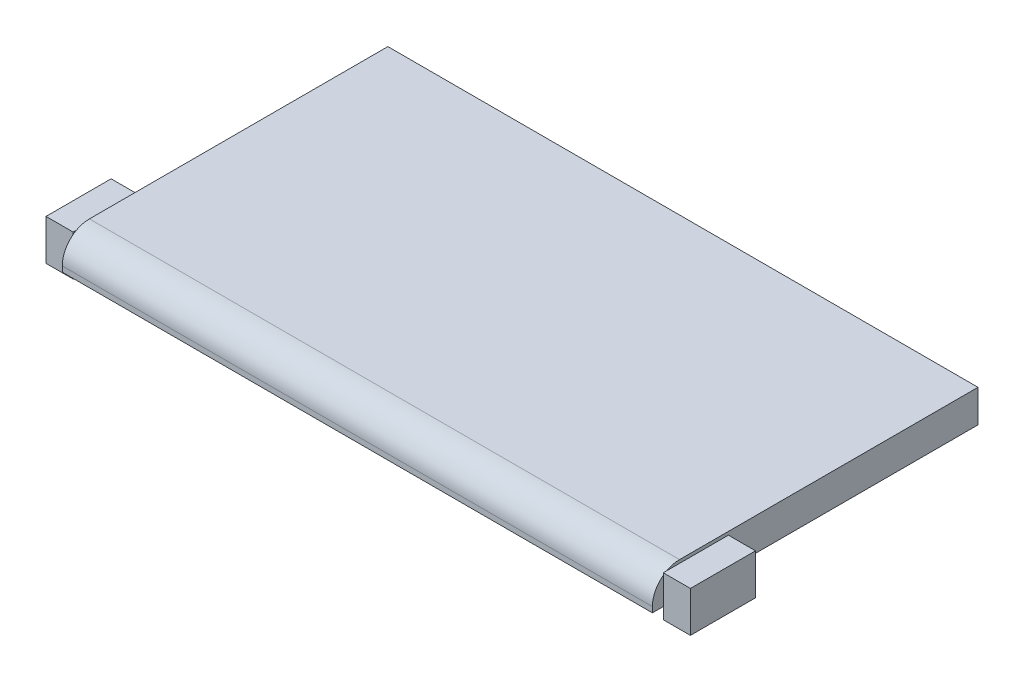
ISO-10303-21;
HEADER;
FILE_DESCRIPTION(('STEP AP214'),'2;1');
FILE_NAME('part.step','',(''),(''),'','','');
FILE_SCHEMA(('AUTOMOTIVE_DESIGN { 1 0 10303 214 1 1 1 1 }'));
ENDSEC;
DATA;
#1=APPLICATION_CONTEXT('core data for automotive mechanical design processes');
#2=APPLICATION_PROTOCOL_DEFINITION('international standard','automotive_design',2000,#1);
#3=PRODUCT_CONTEXT('',#1,'mechanical');
#4=PRODUCT('Part','Part','',(#3));
#5=PRODUCT_RELATED_PRODUCT_CATEGORY('part','',(#4));
#6=PRODUCT_DEFINITION_FORMATION('','',#4);
#7=PRODUCT_DEFINITION_CONTEXT('part definition',#1,'design');
#8=PRODUCT_DEFINITION('design','',#6,#7);
#9=PRODUCT_DEFINITION_SHAPE('','',#8);
#10=(LENGTH_UNIT() NAMED_UNIT(*) SI_UNIT(.MILLI.,.METRE.));
#11=(NAMED_UNIT(*) PLANE_ANGLE_UNIT() SI_UNIT($,.RADIAN.));
#12=(NAMED_UNIT(*) SI_UNIT($,.STERADIAN.) SOLID_ANGLE_UNIT());
#13=UNCERTAINTY_MEASURE_WITH_UNIT(LENGTH_MEASURE(1.E-05),#10,'distance_accuracy_value','');
#14=(GEOMETRIC_REPRESENTATION_CONTEXT(3) GLOBAL_UNCERTAINTY_ASSIGNED_CONTEXT((#13)) GLOBAL_UNIT_ASSIGNED_CONTEXT((#10,
#11,#12)) REPRESENTATION_CONTEXT('',''));
#15=CARTESIAN_POINT('',(0.,0.,0.));
#16=DIRECTION('',(0.,0.,1.));
#17=DIRECTION('',(1.,0.,0.));
#18=AXIS2_PLACEMENT_3D('',#15,#16,#17);
#19=CARTESIAN_POINT('',(287.401,13.716,-3.556));
#20=DIRECTION('',(0.,0.,-1.));
#21=DIRECTION('',(-1.,0.,0.));
#22=AXIS2_PLACEMENT_3D('',#19,#20,#21);
#23=PLANE('',#22);
#24=DIRECTION('',(0.,-1.,0.));
#25=VECTOR('',#24,1.);
#26=CARTESIAN_POINT('',(274.701,13.716,-3.556));
#27=LINE('',#26,#25);
#28=CARTESIAN_POINT('',(274.701,13.716,-3.556));
#29=VERTEX_POINT('',#28);
#30=CARTESIAN_POINT('',(274.701,-5.334,-3.556));
#31=VERTEX_POINT('',#30);
#32=EDGE_CURVE('E125',#29,#31,#27,.T.);
#33=ORIENTED_EDGE('',*,*,#32,.T.);
#34=DIRECTION('',(-1.,0.,0.));
#35=VECTOR('',#34,1.);
#36=CARTESIAN_POINT('',(287.401,-5.334,-3.55600000000001));
#37=LINE('',#36,#35);
#38=CARTESIAN_POINT('',(287.401,-5.334,-3.55600000000001));
#39=VERTEX_POINT('',#38);
#40=EDGE_CURVE('E12',#39,#31,#37,.T.);
#41=ORIENTED_EDGE('',*,*,#40,.F.);
#42=DIRECTION('',(0.,-1.,0.));
#43=VECTOR('',#42,1.);
#44=CARTESIAN_POINT('',(287.401,13.716,-3.556));
#45=LINE('',#44,#43);
#46=CARTESIAN_POINT('',(287.401,13.716,-3.556));
#47=VERTEX_POINT('',#46);
#48=EDGE_CURVE('E113',#47,#39,#45,.T.);
#49=ORIENTED_EDGE('',*,*,#48,.F.);
#50=DIRECTION('',(-1.,0.,0.));
#51=VECTOR('',#50,1.);
#52=CARTESIAN_POINT('',(287.401,13.716,-3.556));
#53=LINE('',#52,#51);
#54=EDGE_CURVE('E121',#47,#29,#53,.T.);
#55=ORIENTED_EDGE('',*,*,#54,.T.);
#56=EDGE_LOOP('',(#33,#41,#49,#55));
#57=FACE_BOUND('',#56,.T.);
#58=ADVANCED_FACE('F62',(#57),#23,.F.);
#59=CARTESIAN_POINT('',(287.401,-5.334,-3.55600000000001));
#60=DIRECTION('',(0.,1.,0.));
#61=DIRECTION('',(0.,0.,1.));
#62=AXIS2_PLACEMENT_3D('',#59,#60,#61);
#63=PLANE('',#62);
#64=DIRECTION('',(0.,0.,-1.));
#65=VECTOR('',#64,1.);
#66=CARTESIAN_POINT('',(274.701,-5.334,-3.556));
#67=LINE('',#66,#65);
#68=CARTESIAN_POINT('',(274.701,-5.334,-34.036));
#69=VERTEX_POINT('',#68);
#70=EDGE_CURVE('E117',#31,#69,#67,.T.);
#71=ORIENTED_EDGE('',*,*,#70,.T.);
#72=DIRECTION('',(-1.,0.,0.));
#73=VECTOR('',#72,1.);
#74=CARTESIAN_POINT('',(287.401,-5.334,-34.036));
#75=LINE('',#74,#73);
#76=CARTESIAN_POINT('',(287.401,-5.334,-34.036));
#77=VERTEX_POINT('',#76);
#78=EDGE_CURVE('E70',#77,#69,#75,.T.);
#79=ORIENTED_EDGE('',*,*,#78,.F.);
#80=DIRECTION('',(0.,0.,-1.));
#81=VECTOR('',#80,1.);
#82=CARTESIAN_POINT('',(287.401,-5.334,-3.55600000000001));
#83=LINE('',#82,#81);
#84=EDGE_CURVE('E108',#39,#77,#83,.T.);
#85=ORIENTED_EDGE('',*,*,#84,.F.);
#86=ORIENTED_EDGE('',*,*,#40,.T.);
#87=EDGE_LOOP('',(#71,#79,#85,#86));
#88=FACE_BOUND('',#87,.T.);
#89=ADVANCED_FACE('F116',(#88),#63,.F.);
#90=CARTESIAN_POINT('',(287.401,13.716,-34.036));
#91=DIRECTION('',(0.,0.,1.));
#92=DIRECTION('',(1.,0.,0.));
#93=AXIS2_PLACEMENT_3D('',#90,#91,#92);
#94=PLANE('',#93);
#95=DIRECTION('',(0.,1.,0.));
#96=VECTOR('',#95,1.);
#97=CARTESIAN_POINT('',(274.701,13.716,-34.036));
#98=LINE('',#97,#96);
#99=CARTESIAN_POINT('',(274.701,13.716,-34.036));
#100=VERTEX_POINT('',#99);
#101=EDGE_CURVE('E95',#69,#100,#98,.T.);
#102=ORIENTED_EDGE('',*,*,#101,.T.);
#103=DIRECTION('',(-1.,0.,0.));
#104=VECTOR('',#103,1.);
#105=CARTESIAN_POINT('',(287.401,13.716,-34.036));
#106=LINE('',#105,#104);
#107=CARTESIAN_POINT('',(287.401,13.716,-34.036));
#108=VERTEX_POINT('',#107);
#109=EDGE_CURVE('E118',#108,#100,#106,.T.);
#110=ORIENTED_EDGE('',*,*,#109,.F.);
#111=DIRECTION('',(0.,1.,0.));
#112=VECTOR('',#111,1.);
#113=CARTESIAN_POINT('',(287.401,13.716,-34.036));
#114=LINE('',#113,#112);
#115=EDGE_CURVE('E111',#77,#108,#114,.T.);
#116=ORIENTED_EDGE('',*,*,#115,.F.);
#117=ORIENTED_EDGE('',*,*,#78,.T.);
#118=EDGE_LOOP('',(#102,#110,#116,#117));
#119=FACE_BOUND('',#118,.T.);
#120=ADVANCED_FACE('F119',(#119),#94,.F.);
#121=CARTESIAN_POINT('',(287.401,13.716,-3.556));
#122=DIRECTION('',(0.,-1.,0.));
#123=DIRECTION('',(0.,0.,-1.));
#124=AXIS2_PLACEMENT_3D('',#121,#122,#123);
#125=PLANE('',#124);
#126=DIRECTION('',(0.,0.,1.));
#127=VECTOR('',#126,1.);
#128=CARTESIAN_POINT('',(274.701,13.716,-3.556));
#129=LINE('',#128,#127);
#130=EDGE_CURVE('E101',#100,#29,#129,.T.);
#131=ORIENTED_EDGE('',*,*,#130,.T.);
#132=ORIENTED_EDGE('',*,*,#54,.F.);
#133=DIRECTION('',(0.,0.,1.));
#134=VECTOR('',#133,1.);
#135=CARTESIAN_POINT('',(287.401,13.716,-3.556));
#136=LINE('',#135,#134);
#137=EDGE_CURVE('E78',#108,#47,#136,.T.);
#138=ORIENTED_EDGE('',*,*,#137,.F.);
#139=ORIENTED_EDGE('',*,*,#109,.T.);
#140=EDGE_LOOP('',(#131,#132,#138,#139));
#141=FACE_BOUND('',#140,.T.);
#142=ADVANCED_FACE('F132',(#141),#125,.F.);
#143=CARTESIAN_POINT('',(287.401,0.,0.));
#144=DIRECTION('',(1.,0.,0.));
#145=DIRECTION('',(0.,0.,-1.));
#146=AXIS2_PLACEMENT_3D('',#143,#144,#145);
#147=PLANE('',#146);
#148=ORIENTED_EDGE('',*,*,#48,.T.);
#149=ORIENTED_EDGE('',*,*,#84,.T.);
#150=ORIENTED_EDGE('',*,*,#115,.T.);
#151=ORIENTED_EDGE('',*,*,#137,.T.);
#152=EDGE_LOOP('',(#148,#149,#150,#151));
#153=FACE_BOUND('',#152,.T.);
#154=ADVANCED_FACE('F109',(#153),#147,.T.);
#155=CARTESIAN_POINT('',(274.701,0.,0.));
#156=DIRECTION('',(1.,0.,0.));
#157=DIRECTION('',(0.,0.,-1.));
#158=AXIS2_PLACEMENT_3D('',#155,#156,#157);
#159=PLANE('',#158);
#160=ORIENTED_EDGE('',*,*,#32,.F.);
#161=ORIENTED_EDGE('',*,*,#130,.F.);
#162=ORIENTED_EDGE('',*,*,#101,.F.);
#163=ORIENTED_EDGE('',*,*,#70,.F.);
#164=EDGE_LOOP('',(#160,#161,#162,#163));
#165=FACE_BOUND('',#164,.T.);
#166=ADVANCED_FACE('F135',(#165),#159,.F.);
#167=CLOSED_SHELL('',(#58,#89,#120,#142,#154,#166));
#168=MANIFOLD_SOLID_BREP('B2',#167);
#169=CARTESIAN_POINT('',(-1.524,15.24,0.));
#170=DIRECTION('',(-1.,0.,0.));
#171=DIRECTION('',(0.,0.,1.));
#172=AXIS2_PLACEMENT_3D('',#169,#170,#171);
#173=PLANE('',#172);
#174=CARTESIAN_POINT('',(-1.524,2.54,-11.176));
#175=DIRECTION('',(-1.,0.,0.));
#176=DIRECTION('',(0.,0.,1.));
#177=AXIS2_PLACEMENT_3D('',#174,#175,#176);
#178=CIRCLE('',#177,12.7);
#179=CARTESIAN_POINT('',(-1.524,2.54,1.524));
#180=VERTEX_POINT('',#179);
#181=CARTESIAN_POINT('',(-1.52400000000003,12.7,-3.55599999999995));
#182=VERTEX_POINT('',#181);
#183=EDGE_CURVE('E213',#180,#182,#178,.T.);
#184=ORIENTED_EDGE('',*,*,#183,.T.);
#185=DIRECTION('',(0.,-1.,0.));
#186=VECTOR('',#185,1.);
#187=CARTESIAN_POINT('',(-1.52400000000003,13.716,-3.55599999999995));
#188=LINE('',#187,#186);
#189=CARTESIAN_POINT('',(-1.52400000000003,0.,-3.55599999999995));
#190=VERTEX_POINT('',#189);
#191=EDGE_CURVE('E60',#182,#190,#188,.T.);
#192=ORIENTED_EDGE('',*,*,#191,.T.);
#193=DIRECTION('',(0.,0.,-1.));
#194=VECTOR('',#193,1.);
#195=CARTESIAN_POINT('',(-1.524,0.,0.));
#196=LINE('',#195,#194);
#197=CARTESIAN_POINT('',(-1.524,0.,1.524));
#198=VERTEX_POINT('',#197);
#199=EDGE_CURVE('E498',#198,#190,#196,.T.);
#200=ORIENTED_EDGE('',*,*,#199,.F.);
#201=DIRECTION('',(0.,-1.,0.));
#202=VECTOR('',#201,1.);
#203=CARTESIAN_POINT('',(-1.524,15.24,1.524));
#204=LINE('',#203,#202);
#205=EDGE_CURVE('E505',#180,#198,#204,.T.);
#206=ORIENTED_EDGE('',*,*,#205,.F.);
#207=EDGE_LOOP('',(#184,#192,#200,#206));
#208=FACE_BOUND('',#207,.T.);
#209=ADVANCED_FACE('F209',(#208),#173,.T.);
#210=CARTESIAN_POINT('',(-1.52400000000003,0.,-34.0359999999999));
#211=VERTEX_POINT('',#210);
#212=CARTESIAN_POINT('',(-1.524,0.,-150.876));
#213=VERTEX_POINT('',#212);
#214=EDGE_CURVE('E518',#211,#213,#196,.T.);
#215=ORIENTED_EDGE('',*,*,#214,.F.);
#216=DIRECTION('',(0.,1.,0.));
#217=VECTOR('',#216,1.);
#218=CARTESIAN_POINT('',(-1.52400000000003,13.716,-34.0359999999999));
#219=LINE('',#218,#217);
#220=CARTESIAN_POINT('',(-1.52400000000003,13.716,-34.0359999999999));
#221=VERTEX_POINT('',#220);
#222=EDGE_CURVE('E219',#211,#221,#219,.T.);
#223=ORIENTED_EDGE('',*,*,#222,.T.);
#224=DIRECTION('',(0.,0.,1.));
#225=VECTOR('',#224,1.);
#226=CARTESIAN_POINT('',(-1.52400000000003,13.716,-3.55599999999995));
#227=LINE('',#226,#225);
#228=CARTESIAN_POINT('',(-1.524,13.716,-5.14383421978473));
#229=VERTEX_POINT('',#228);
#230=EDGE_CURVE('E397',#221,#229,#227,.T.);
#231=ORIENTED_EDGE('',*,*,#230,.T.);
#232=CARTESIAN_POINT('',(-1.524,15.24,-11.176));
#233=VERTEX_POINT('',#232);
#234=EDGE_CURVE('E543',#229,#233,#178,.T.);
#235=ORIENTED_EDGE('',*,*,#234,.T.);
#236=DIRECTION('',(0.,0.,-1.));
#237=VECTOR('',#236,1.);
#238=CARTESIAN_POINT('',(-1.524,15.24,0.));
#239=LINE('',#238,#237);
#240=CARTESIAN_POINT('',(-1.524,15.24,-150.876));
#241=VERTEX_POINT('',#240);
#242=EDGE_CURVE('E502',#233,#241,#239,.T.);
#243=ORIENTED_EDGE('',*,*,#242,.T.);
#244=DIRECTION('',(0.,-1.,0.));
#245=VECTOR('',#244,1.);
#246=CARTESIAN_POINT('',(-1.524,15.24,-150.876));
#247=LINE('',#246,#245);
#248=EDGE_CURVE('E524',#241,#213,#247,.T.);
#249=ORIENTED_EDGE('',*,*,#248,.T.);
#250=EDGE_LOOP('',(#215,#223,#231,#235,#243,#249));
#251=FACE_BOUND('',#250,.T.);
#252=ADVANCED_FACE('F561',(#251),#173,.T.);
#253=CARTESIAN_POINT('',(0.,15.24,1.524));
#254=DIRECTION('',(0.,0.,-1.));
#255=DIRECTION('',(-1.,0.,0.));
#256=AXIS2_PLACEMENT_3D('',#253,#254,#255);
#257=PLANE('',#256);
#258=DIRECTION('',(0.,-1.,0.));
#259=VECTOR('',#258,1.);
#260=CARTESIAN_POINT('',(274.701,15.24,1.524));
#261=LINE('',#260,#259);
#262=CARTESIAN_POINT('',(274.701,2.54,1.524));
#263=VERTEX_POINT('',#262);
#264=CARTESIAN_POINT('',(274.701,0.,1.524));
#265=VERTEX_POINT('',#264);
#266=EDGE_CURVE('E532',#263,#265,#261,.T.);
#267=ORIENTED_EDGE('',*,*,#266,.F.);
#268=DIRECTION('',(1.,0.,0.));
#269=VECTOR('',#268,1.);
#270=CARTESIAN_POINT('',(-1.524,2.54,1.524));
#271=LINE('',#270,#269);
#272=EDGE_CURVE('E541',#263,#180,#271,.F.);
#273=ORIENTED_EDGE('',*,*,#272,.T.);
#274=ORIENTED_EDGE('',*,*,#205,.T.);
#275=DIRECTION('',(1.,0.,0.));
#276=VECTOR('',#275,1.);
#277=CARTESIAN_POINT('',(0.,0.,1.524));
#278=LINE('',#277,#276);
#279=EDGE_CURVE('E475',#198,#265,#278,.T.);
#280=ORIENTED_EDGE('',*,*,#279,.T.);
#281=EDGE_LOOP('',(#267,#273,#274,#280));
#282=FACE_BOUND('',#281,.T.);
#283=ADVANCED_FACE('F625',(#282),#257,.F.);
#284=CARTESIAN_POINT('',(274.701,15.24,-1.00058850094342E-13));
#285=DIRECTION('',(-1.,0.,0.));
#286=DIRECTION('',(0.,0.,1.));
#287=AXIS2_PLACEMENT_3D('',#284,#285,#286);
#288=PLANE('',#287);
#289=DIRECTION('',(0.,0.,-1.));
#290=VECTOR('',#289,1.);
#291=CARTESIAN_POINT('',(274.701,15.24,-1.00058850094342E-13));
#292=LINE('',#291,#290);
#293=CARTESIAN_POINT('',(274.701,15.24,-11.176));
#294=VERTEX_POINT('',#293);
#295=CARTESIAN_POINT('',(274.701,15.24,-150.876));
#296=VERTEX_POINT('',#295);
#297=EDGE_CURVE('E494',#294,#296,#292,.T.);
#298=ORIENTED_EDGE('',*,*,#297,.F.);
#299=CARTESIAN_POINT('',(274.701,2.54,-11.176));
#300=DIRECTION('',(-1.,0.,0.));
#301=DIRECTION('',(0.,0.,1.));
#302=AXIS2_PLACEMENT_3D('',#299,#300,#301);
#303=CIRCLE('',#302,12.7);
#304=EDGE_CURVE('E539',#294,#263,#303,.F.);
#305=ORIENTED_EDGE('',*,*,#304,.T.);
#306=ORIENTED_EDGE('',*,*,#266,.T.);
#307=DIRECTION('',(0.,0.,-1.));
#308=VECTOR('',#307,1.);
#309=CARTESIAN_POINT('',(274.701,0.,-1.00058850094342E-13));
#310=LINE('',#309,#308);
#311=CARTESIAN_POINT('',(274.701,0.,-150.876));
#312=VERTEX_POINT('',#311);
#313=EDGE_CURVE('E509',#265,#312,#310,.T.);
#314=ORIENTED_EDGE('',*,*,#313,.T.);
#315=DIRECTION('',(0.,-1.,0.));
#316=VECTOR('',#315,1.);
#317=CARTESIAN_POINT('',(274.701,15.24,-150.876));
#318=LINE('',#317,#316);
#319=EDGE_CURVE('E528',#296,#312,#318,.T.);
#320=ORIENTED_EDGE('',*,*,#319,.F.);
#321=EDGE_LOOP('',(#298,#305,#306,#314,#320));
#322=FACE_BOUND('',#321,.T.);
#323=ADVANCED_FACE('F579',(#322),#288,.F.);
#324=CARTESIAN_POINT('',(0.,15.24,-150.876));
#325=DIRECTION('',(0.,0.,-1.));
#326=DIRECTION('',(-1.,0.,0.));
#327=AXIS2_PLACEMENT_3D('',#324,#325,#326);
#328=PLANE('',#327);
#329=DIRECTION('',(0.,-1.,0.));
#330=VECTOR('',#329,1.);
#331=CARTESIAN_POINT('',(187.3885,0.,-150.876));
#332=LINE('',#331,#330);
#333=CARTESIAN_POINT('',(187.3885,3.175,-150.876));
#334=VERTEX_POINT('',#333);
#335=CARTESIAN_POINT('',(187.3885,0.,-150.876));
#336=VERTEX_POINT('',#335);
#337=EDGE_CURVE('E415',#334,#336,#332,.T.);
#338=ORIENTED_EDGE('',*,*,#337,.F.);
#339=DIRECTION('',(-1.,0.,0.));
#340=VECTOR('',#339,1.);
#341=CARTESIAN_POINT('',(187.3885,3.175,-150.876));
#342=LINE('',#341,#340);
#343=CARTESIAN_POINT('',(85.7885,3.175,-150.876));
#344=VERTEX_POINT('',#343);
#345=EDGE_CURVE('E434',#334,#344,#342,.T.);
#346=ORIENTED_EDGE('',*,*,#345,.T.);
#347=DIRECTION('',(0.,-1.,0.));
#348=VECTOR('',#347,1.);
#349=CARTESIAN_POINT('',(85.7885,0.,-150.876));
#350=LINE('',#349,#348);
#351=CARTESIAN_POINT('',(85.7885,0.,-150.876));
#352=VERTEX_POINT('',#351);
#353=EDGE_CURVE('E409',#344,#352,#350,.T.);
#354=ORIENTED_EDGE('',*,*,#353,.T.);
#355=DIRECTION('',(1.,0.,0.));
#356=VECTOR('',#355,1.);
#357=CARTESIAN_POINT('',(0.,0.,-150.876));
#358=LINE('',#357,#356);
#359=EDGE_CURVE('E514',#213,#352,#358,.T.);
#360=ORIENTED_EDGE('',*,*,#359,.F.);
#361=ORIENTED_EDGE('',*,*,#248,.F.);
#362=DIRECTION('',(1.,0.,0.));
#363=VECTOR('',#362,1.);
#364=CARTESIAN_POINT('',(0.,15.24,-150.876));
#365=LINE('',#364,#363);
#366=EDGE_CURVE('E497',#241,#296,#365,.T.);
#367=ORIENTED_EDGE('',*,*,#366,.T.);
#368=ORIENTED_EDGE('',*,*,#319,.T.);
#369=EDGE_CURVE('E513',#336,#312,#358,.T.);
#370=ORIENTED_EDGE('',*,*,#369,.F.);
#371=EDGE_LOOP('',(#338,#346,#354,#360,#361,#367,#368,#370));
#372=FACE_BOUND('',#371,.T.);
#373=ADVANCED_FACE('F585',(#372),#328,.T.);
#374=CARTESIAN_POINT('',(0.,15.24,0.));
#375=DIRECTION('',(0.,1.,0.));
#376=DIRECTION('',(0.,0.,1.));
#377=AXIS2_PLACEMENT_3D('',#374,#375,#376);
#378=PLANE('',#377);
#379=ORIENTED_EDGE('',*,*,#242,.F.);
#380=DIRECTION('',(1.,0.,0.));
#381=VECTOR('',#380,1.);
#382=CARTESIAN_POINT('',(274.701,15.24,-11.176));
#383=LINE('',#382,#381);
#384=EDGE_CURVE('E535',#233,#294,#383,.T.);
#385=ORIENTED_EDGE('',*,*,#384,.T.);
#386=ORIENTED_EDGE('',*,*,#297,.T.);
#387=ORIENTED_EDGE('',*,*,#366,.F.);
#388=EDGE_LOOP('',(#379,#385,#386,#387));
#389=FACE_BOUND('',#388,.T.);
#390=ADVANCED_FACE('F575',(#389),#378,.T.);
#391=CARTESIAN_POINT('',(0.,0.,0.));
#392=DIRECTION('',(0.,1.,0.));
#393=DIRECTION('',(0.,0.,1.));
#394=AXIS2_PLACEMENT_3D('',#391,#392,#393);
#395=PLANE('',#394);
#396=DIRECTION('',(0.,0.,-1.));
#397=VECTOR('',#396,1.);
#398=CARTESIAN_POINT('',(0.,0.,0.));
#399=LINE('',#398,#397);
#400=CARTESIAN_POINT('',(0.,0.,0.));
#401=VERTEX_POINT('',#400);
#402=CARTESIAN_POINT('',(0.,0.,-149.352));
#403=VERTEX_POINT('',#402);
#404=EDGE_CURVE('E462',#401,#403,#399,.T.);
#405=ORIENTED_EDGE('',*,*,#404,.F.);
#406=DIRECTION('',(1.,0.,0.));
#407=VECTOR('',#406,1.);
#408=CARTESIAN_POINT('',(0.,0.,0.));
#409=LINE('',#408,#407);
#410=CARTESIAN_POINT('',(273.177,0.,0.));
#411=VERTEX_POINT('',#410);
#412=EDGE_CURVE('E442',#401,#411,#409,.T.);
#413=ORIENTED_EDGE('',*,*,#412,.T.);
#414=DIRECTION('',(0.,0.,-1.));
#415=VECTOR('',#414,1.);
#416=CARTESIAN_POINT('',(273.177,0.,0.));
#417=LINE('',#416,#415);
#418=CARTESIAN_POINT('',(273.177,0.,-149.352));
#419=VERTEX_POINT('',#418);
#420=EDGE_CURVE('E484',#411,#419,#417,.T.);
#421=ORIENTED_EDGE('',*,*,#420,.T.);
#422=DIRECTION('',(1.,0.,0.));
#423=VECTOR('',#422,1.);
#424=CARTESIAN_POINT('',(0.,0.,-149.352));
#425=LINE('',#424,#423);
#426=EDGE_CURVE('E488',#403,#419,#425,.T.);
#427=ORIENTED_EDGE('',*,*,#426,.F.);
#428=EDGE_LOOP('',(#405,#413,#421,#427));
#429=FACE_BOUND('',#428,.T.);
#430=ORIENTED_EDGE('',*,*,#279,.F.);
#431=ORIENTED_EDGE('',*,*,#199,.T.);
#432=EDGE_CURVE('E351',#190,#211,#196,.T.);
#433=ORIENTED_EDGE('',*,*,#432,.T.);
#434=ORIENTED_EDGE('',*,*,#214,.T.);
#435=ORIENTED_EDGE('',*,*,#359,.T.);
#436=DIRECTION('',(-1.,0.,0.));
#437=VECTOR('',#436,1.);
#438=CARTESIAN_POINT('',(187.3885,0.,-150.876));
#439=LINE('',#438,#437);
#440=EDGE_CURVE('E418',#336,#352,#439,.T.);
#441=ORIENTED_EDGE('',*,*,#440,.F.);
#442=ORIENTED_EDGE('',*,*,#369,.T.);
#443=ORIENTED_EDGE('',*,*,#313,.F.);
#444=EDGE_LOOP('',(#430,#431,#433,#434,#435,#441,#442,#443));
#445=FACE_BOUND('',#444,.T.);
#446=ADVANCED_FACE('F591',(#429,#445),#395,.F.);
#447=CARTESIAN_POINT('',(0.,2.54,-11.176));
#448=DIRECTION('',(-1.,0.,0.));
#449=DIRECTION('',(0.,0.,1.));
#450=AXIS2_PLACEMENT_3D('',#447,#448,#449);
#451=CYLINDRICAL_SURFACE('',#450,12.7);
#452=ORIENTED_EDGE('',*,*,#183,.F.);
#453=ORIENTED_EDGE('',*,*,#272,.F.);
#454=ORIENTED_EDGE('',*,*,#304,.F.);
#455=ORIENTED_EDGE('',*,*,#384,.F.);
#456=ORIENTED_EDGE('',*,*,#234,.F.);
#457=EDGE_CURVE('E549',#182,#229,#178,.T.);
#458=ORIENTED_EDGE('',*,*,#457,.F.);
#459=EDGE_LOOP('',(#452,#453,#454,#455,#456,#458));
#460=FACE_BOUND('',#459,.T.);
#461=ADVANCED_FACE('F211',(#460),#451,.T.);
#462=CARTESIAN_POINT('',(0.,15.24,0.));
#463=DIRECTION('',(0.,0.,-1.));
#464=DIRECTION('',(-1.,0.,0.));
#465=AXIS2_PLACEMENT_3D('',#462,#463,#464);
#466=PLANE('',#465);
#467=DIRECTION('',(0.,-1.,0.));
#468=VECTOR('',#467,1.);
#469=CARTESIAN_POINT('',(273.177,15.24,0.));
#470=LINE('',#469,#468);
#471=CARTESIAN_POINT('',(273.177,2.54000000000001,0.));
#472=VERTEX_POINT('',#471);
#473=EDGE_CURVE('E443',#472,#411,#470,.T.);
#474=ORIENTED_EDGE('',*,*,#473,.T.);
#475=ORIENTED_EDGE('',*,*,#412,.F.);
#476=DIRECTION('',(0.,-1.,0.));
#477=VECTOR('',#476,1.);
#478=CARTESIAN_POINT('',(0.,15.24,0.));
#479=LINE('',#478,#477);
#480=CARTESIAN_POINT('',(0.,2.54000000000001,0.));
#481=VERTEX_POINT('',#480);
#482=EDGE_CURVE('E453',#481,#401,#479,.T.);
#483=ORIENTED_EDGE('',*,*,#482,.F.);
#484=DIRECTION('',(-1.,0.,0.));
#485=VECTOR('',#484,1.);
#486=CARTESIAN_POINT('',(0.,2.54000000000001,0.));
#487=LINE('',#486,#485);
#488=EDGE_CURVE('E448',#472,#481,#487,.T.);
#489=ORIENTED_EDGE('',*,*,#488,.F.);
#490=EDGE_LOOP('',(#474,#475,#483,#489));
#491=FACE_BOUND('',#490,.T.);
#492=ADVANCED_FACE('F652',(#491),#466,.T.);
#493=CARTESIAN_POINT('',(273.177,15.24,0.));
#494=DIRECTION('',(-1.,0.,0.));
#495=DIRECTION('',(0.,0.,1.));
#496=AXIS2_PLACEMENT_3D('',#493,#494,#495);
#497=PLANE('',#496);
#498=DIRECTION('',(0.,0.,-1.));
#499=VECTOR('',#498,1.);
#500=CARTESIAN_POINT('',(273.177,13.716,0.));
#501=LINE('',#500,#499);
#502=CARTESIAN_POINT('',(273.177,13.716,-11.176));
#503=VERTEX_POINT('',#502);
#504=CARTESIAN_POINT('',(273.177,13.716,-149.352));
#505=VERTEX_POINT('',#504);
#506=EDGE_CURVE('E458',#503,#505,#501,.T.);
#507=ORIENTED_EDGE('',*,*,#506,.T.);
#508=DIRECTION('',(0.,-1.,0.));
#509=VECTOR('',#508,1.);
#510=CARTESIAN_POINT('',(273.177,15.24,-149.352));
#511=LINE('',#510,#509);
#512=EDGE_CURVE('E447',#505,#419,#511,.T.);
#513=ORIENTED_EDGE('',*,*,#512,.T.);
#514=ORIENTED_EDGE('',*,*,#420,.F.);
#515=ORIENTED_EDGE('',*,*,#473,.F.);
#516=CARTESIAN_POINT('',(273.177,2.54,-11.176));
#517=DIRECTION('',(-1.,0.,0.));
#518=DIRECTION('',(0.,0.,1.));
#519=AXIS2_PLACEMENT_3D('',#516,#517,#518);
#520=CIRCLE('',#519,11.176);
#521=EDGE_CURVE('E452',#503,#472,#520,.F.);
#522=ORIENTED_EDGE('',*,*,#521,.F.);
#523=EDGE_LOOP('',(#507,#513,#514,#515,#522));
#524=FACE_BOUND('',#523,.T.);
#525=ADVANCED_FACE('F656',(#524),#497,.T.);
#526=CARTESIAN_POINT('',(0.,15.24,-149.352));
#527=DIRECTION('',(0.,0.,-1.));
#528=DIRECTION('',(-1.,0.,0.));
#529=AXIS2_PLACEMENT_3D('',#526,#527,#528);
#530=PLANE('',#529);
#531=ORIENTED_EDGE('',*,*,#426,.T.);
#532=ORIENTED_EDGE('',*,*,#512,.F.);
#533=DIRECTION('',(1.,0.,0.));
#534=VECTOR('',#533,1.);
#535=CARTESIAN_POINT('',(0.,13.716,-149.352));
#536=LINE('',#535,#534);
#537=CARTESIAN_POINT('',(0.,13.716,-149.352));
#538=VERTEX_POINT('',#537);
#539=EDGE_CURVE('E461',#538,#505,#536,.T.);
#540=ORIENTED_EDGE('',*,*,#539,.F.);
#541=DIRECTION('',(0.,-1.,0.));
#542=VECTOR('',#541,1.);
#543=CARTESIAN_POINT('',(0.,15.24,-149.352));
#544=LINE('',#543,#542);
#545=EDGE_CURVE('E456',#538,#403,#544,.T.);
#546=ORIENTED_EDGE('',*,*,#545,.T.);
#547=EDGE_LOOP('',(#531,#532,#540,#546));
#548=FACE_BOUND('',#547,.T.);
#549=ADVANCED_FACE('F666',(#548),#530,.F.);
#550=CARTESIAN_POINT('',(0.,15.24,0.));
#551=DIRECTION('',(-1.,0.,0.));
#552=DIRECTION('',(0.,0.,1.));
#553=AXIS2_PLACEMENT_3D('',#550,#551,#552);
#554=PLANE('',#553);
#555=ORIENTED_EDGE('',*,*,#482,.T.);
#556=ORIENTED_EDGE('',*,*,#404,.T.);
#557=ORIENTED_EDGE('',*,*,#545,.F.);
#558=DIRECTION('',(0.,0.,-1.));
#559=VECTOR('',#558,1.);
#560=CARTESIAN_POINT('',(0.,13.716,0.));
#561=LINE('',#560,#559);
#562=CARTESIAN_POINT('',(0.,13.716,-11.176));
#563=VERTEX_POINT('',#562);
#564=EDGE_CURVE('E457',#563,#538,#561,.T.);
#565=ORIENTED_EDGE('',*,*,#564,.F.);
#566=CARTESIAN_POINT('',(0.,2.54,-11.176));
#567=DIRECTION('',(-1.,0.,0.));
#568=DIRECTION('',(0.,0.,1.));
#569=AXIS2_PLACEMENT_3D('',#566,#567,#568);
#570=CIRCLE('',#569,11.176);
#571=EDGE_CURVE('E451',#481,#563,#570,.T.);
#572=ORIENTED_EDGE('',*,*,#571,.F.);
#573=EDGE_LOOP('',(#555,#556,#557,#565,#572));
#574=FACE_BOUND('',#573,.T.);
#575=ADVANCED_FACE('F675',(#574),#554,.F.);
#576=CARTESIAN_POINT('',(0.,13.716,0.));
#577=DIRECTION('',(0.,1.,0.));
#578=DIRECTION('',(0.,0.,1.));
#579=AXIS2_PLACEMENT_3D('',#576,#577,#578);
#580=PLANE('',#579);
#581=ORIENTED_EDGE('',*,*,#564,.T.);
#582=ORIENTED_EDGE('',*,*,#539,.T.);
#583=ORIENTED_EDGE('',*,*,#506,.F.);
#584=DIRECTION('',(1.,0.,0.));
#585=VECTOR('',#584,1.);
#586=CARTESIAN_POINT('',(0.,13.716,-11.176));
#587=LINE('',#586,#585);
#588=EDGE_CURVE('E446',#563,#503,#587,.T.);
#589=ORIENTED_EDGE('',*,*,#588,.F.);
#590=EDGE_LOOP('',(#581,#582,#583,#589));
#591=FACE_BOUND('',#590,.T.);
#592=ADVANCED_FACE('F615',(#591),#580,.F.);
#593=CARTESIAN_POINT('',(0.,2.54,-11.176));
#594=DIRECTION('',(-1.,0.,0.));
#595=DIRECTION('',(0.,0.,1.));
#596=AXIS2_PLACEMENT_3D('',#593,#594,#595);
#597=CYLINDRICAL_SURFACE('',#596,11.176);
#598=ORIENTED_EDGE('',*,*,#571,.T.);
#599=ORIENTED_EDGE('',*,*,#588,.T.);
#600=ORIENTED_EDGE('',*,*,#521,.T.);
#601=ORIENTED_EDGE('',*,*,#488,.T.);
#602=EDGE_LOOP('',(#598,#599,#600,#601));
#603=FACE_BOUND('',#602,.T.);
#604=ADVANCED_FACE('F606',(#603),#597,.F.);
#605=CARTESIAN_POINT('',(187.3885,0.,-154.051));
#606=DIRECTION('',(-1.,0.,0.));
#607=DIRECTION('',(0.,0.,1.));
#608=AXIS2_PLACEMENT_3D('',#605,#606,#607);
#609=CYLINDRICAL_SURFACE('',#608,3.175);
#610=CARTESIAN_POINT('',(85.7885,0.,-154.051));
#611=DIRECTION('',(1.,0.,0.));
#612=DIRECTION('',(0.,0.,-1.));
#613=AXIS2_PLACEMENT_3D('',#610,#611,#612);
#614=CIRCLE('',#613,3.175);
#615=CARTESIAN_POINT('',(85.7885,3.175,-154.051));
#616=VERTEX_POINT('',#615);
#617=EDGE_CURVE('E422',#352,#616,#614,.T.);
#618=ORIENTED_EDGE('',*,*,#617,.T.);
#619=DIRECTION('',(-1.,0.,0.));
#620=VECTOR('',#619,1.);
#621=CARTESIAN_POINT('',(187.3885,3.175,-154.051));
#622=LINE('',#621,#620);
#623=CARTESIAN_POINT('',(187.3885,3.175,-154.051));
#624=VERTEX_POINT('',#623);
#625=EDGE_CURVE('E438',#624,#616,#622,.T.);
#626=ORIENTED_EDGE('',*,*,#625,.F.);
#627=CARTESIAN_POINT('',(187.3885,0.,-154.051));
#628=DIRECTION('',(1.,0.,0.));
#629=DIRECTION('',(0.,0.,-1.));
#630=AXIS2_PLACEMENT_3D('',#627,#628,#629);
#631=CIRCLE('',#630,3.175);
#632=EDGE_CURVE('E237',#336,#624,#631,.T.);
#633=ORIENTED_EDGE('',*,*,#632,.F.);
#634=ORIENTED_EDGE('',*,*,#440,.T.);
#635=EDGE_LOOP('',(#618,#626,#633,#634));
#636=FACE_BOUND('',#635,.T.);
#637=ADVANCED_FACE('F604',(#636),#609,.T.);
#638=CARTESIAN_POINT('',(187.3885,3.17500000000008,0.));
#639=DIRECTION('',(0.,-1.,0.));
#640=DIRECTION('',(0.,0.,-1.));
#641=AXIS2_PLACEMENT_3D('',#638,#639,#640);
#642=PLANE('',#641);
#643=DIRECTION('',(0.,0.,1.));
#644=VECTOR('',#643,1.);
#645=CARTESIAN_POINT('',(85.7885,3.17500000000008,0.));
#646=LINE('',#645,#644);
#647=EDGE_CURVE('E426',#616,#344,#646,.T.);
#648=ORIENTED_EDGE('',*,*,#647,.T.);
#649=ORIENTED_EDGE('',*,*,#345,.F.);
#650=DIRECTION('',(0.,0.,1.));
#651=VECTOR('',#650,1.);
#652=CARTESIAN_POINT('',(187.3885,3.17500000000008,0.));
#653=LINE('',#652,#651);
#654=EDGE_CURVE('E412',#624,#334,#653,.T.);
#655=ORIENTED_EDGE('',*,*,#654,.F.);
#656=ORIENTED_EDGE('',*,*,#625,.T.);
#657=EDGE_LOOP('',(#648,#649,#655,#656));
#658=FACE_BOUND('',#657,.T.);
#659=ADVANCED_FACE('F600',(#658),#642,.F.);
#660=CARTESIAN_POINT('',(187.3885,0.,-154.051));
#661=DIRECTION('',(-1.,0.,0.));
#662=DIRECTION('',(0.,0.,1.));
#663=AXIS2_PLACEMENT_3D('',#660,#661,#662);
#664=CYLINDRICAL_SURFACE('',#663,1.65100000000002);
#665=CARTESIAN_POINT('',(187.3885,0.,-154.051));
#666=DIRECTION('',(1.,0.,0.));
#667=DIRECTION('',(0.,0.,-1.));
#668=AXIS2_PLACEMENT_3D('',#665,#666,#667);
#669=CIRCLE('',#668,1.65100000000002);
#670=CARTESIAN_POINT('',(187.3885,0.,-155.702));
#671=VERTEX_POINT('',#670);
#672=EDGE_CURVE('E405',#671,#671,#669,.T.);
#673=ORIENTED_EDGE('',*,*,#672,.T.);
#674=EDGE_LOOP('',(#673));
#675=FACE_BOUND('',#674,.T.);
#676=CARTESIAN_POINT('',(85.7885,0.,-154.051));
#677=DIRECTION('',(1.,0.,0.));
#678=DIRECTION('',(0.,0.,-1.));
#679=AXIS2_PLACEMENT_3D('',#676,#677,#678);
#680=CIRCLE('',#679,1.65100000000002);
#681=CARTESIAN_POINT('',(85.7885,0.,-155.702));
#682=VERTEX_POINT('',#681);
#683=EDGE_CURVE('E404',#682,#682,#680,.T.);
#684=ORIENTED_EDGE('',*,*,#683,.F.);
#685=EDGE_LOOP('',(#684));
#686=FACE_BOUND('',#685,.T.);
#687=ADVANCED_FACE('F612',(#675,#686),#664,.F.);
#688=CARTESIAN_POINT('',(187.3885,0.,0.));
#689=DIRECTION('',(1.,0.,0.));
#690=DIRECTION('',(0.,0.,-1.));
#691=AXIS2_PLACEMENT_3D('',#688,#689,#690);
#692=PLANE('',#691);
#693=ORIENTED_EDGE('',*,*,#672,.F.);
#694=EDGE_LOOP('',(#693));
#695=FACE_BOUND('',#694,.T.);
#696=ORIENTED_EDGE('',*,*,#632,.T.);
#697=ORIENTED_EDGE('',*,*,#654,.T.);
#698=ORIENTED_EDGE('',*,*,#337,.T.);
#699=EDGE_LOOP('',(#696,#697,#698));
#700=FACE_BOUND('',#699,.T.);
#701=ADVANCED_FACE('F598',(#695,#700),#692,.T.);
#702=CARTESIAN_POINT('',(85.7885,0.,0.));
#703=DIRECTION('',(1.,0.,0.));
#704=DIRECTION('',(0.,0.,-1.));
#705=AXIS2_PLACEMENT_3D('',#702,#703,#704);
#706=PLANE('',#705);
#707=ORIENTED_EDGE('',*,*,#683,.T.);
#708=EDGE_LOOP('',(#707));
#709=FACE_BOUND('',#708,.T.);
#710=ORIENTED_EDGE('',*,*,#617,.F.);
#711=ORIENTED_EDGE('',*,*,#353,.F.);
#712=ORIENTED_EDGE('',*,*,#647,.F.);
#713=EDGE_LOOP('',(#710,#711,#712));
#714=FACE_BOUND('',#713,.T.);
#715=ADVANCED_FACE('F603',(#709,#714),#706,.F.);
#716=CARTESIAN_POINT('',(-1.52400000000003,0.,0.));
#717=DIRECTION('',(-1.,0.,0.));
#718=DIRECTION('',(0.,0.,-1.));
#719=AXIS2_PLACEMENT_3D('',#716,#717,#718);
#720=PLANE('',#719);
#721=CARTESIAN_POINT('',(-1.52400000000003,13.716,-3.55599999999995));
#722=VERTEX_POINT('',#721);
#723=EDGE_CURVE('E221',#722,#182,#188,.T.);
#724=ORIENTED_EDGE('',*,*,#723,.T.);
#725=ORIENTED_EDGE('',*,*,#457,.T.);
#726=EDGE_CURVE('E229',#229,#722,#227,.T.);
#727=ORIENTED_EDGE('',*,*,#726,.T.);
#728=EDGE_LOOP('',(#724,#725,#727));
#729=FACE_BOUND('',#728,.T.);
#730=ADVANCED_FACE('F570',(#729),#720,.F.);
#731=CARTESIAN_POINT('',(-14.224,13.716,-3.55599999999995));
#732=DIRECTION('',(0.,0.,-1.));
#733=DIRECTION('',(1.,0.,0.));
#734=AXIS2_PLACEMENT_3D('',#731,#732,#733);
#735=PLANE('',#734);
#736=ORIENTED_EDGE('',*,*,#723,.F.);
#737=DIRECTION('',(1.,0.,0.));
#738=VECTOR('',#737,1.);
#739=CARTESIAN_POINT('',(-14.224,13.716,-3.55599999999995));
#740=LINE('',#739,#738);
#741=CARTESIAN_POINT('',(-14.224,13.716,-3.55599999999995));
#742=VERTEX_POINT('',#741);
#743=EDGE_CURVE('E365',#742,#722,#740,.T.);
#744=ORIENTED_EDGE('',*,*,#743,.F.);
#745=DIRECTION('',(0.,-1.,0.));
#746=VECTOR('',#745,1.);
#747=CARTESIAN_POINT('',(-14.224,13.716,-3.55599999999995));
#748=LINE('',#747,#746);
#749=CARTESIAN_POINT('',(-14.224,-5.334,-3.55599999999995));
#750=VERTEX_POINT('',#749);
#751=EDGE_CURVE('E371',#742,#750,#748,.T.);
#752=ORIENTED_EDGE('',*,*,#751,.T.);
#753=DIRECTION('',(1.,0.,0.));
#754=VECTOR('',#753,1.);
#755=CARTESIAN_POINT('',(-14.224,-5.334,-3.55599999999995));
#756=LINE('',#755,#754);
#757=CARTESIAN_POINT('',(-1.52400000000003,-5.334,-3.55599999999995));
#758=VERTEX_POINT('',#757);
#759=EDGE_CURVE('E360',#750,#758,#756,.T.);
#760=ORIENTED_EDGE('',*,*,#759,.T.);
#761=EDGE_CURVE('E222',#190,#758,#188,.T.);
#762=ORIENTED_EDGE('',*,*,#761,.F.);
#763=ORIENTED_EDGE('',*,*,#191,.F.);
#764=EDGE_LOOP('',(#736,#744,#752,#760,#762,#763));
#765=FACE_BOUND('',#764,.T.);
#766=ADVANCED_FACE('F368',(#765),#735,.F.);
#767=CARTESIAN_POINT('',(-14.224,-5.334,-3.55599999999995));
#768=DIRECTION('',(0.,1.,0.));
#769=DIRECTION('',(0.,0.,1.));
#770=AXIS2_PLACEMENT_3D('',#767,#768,#769);
#771=PLANE('',#770);
#772=DIRECTION('',(0.,0.,-1.));
#773=VECTOR('',#772,1.);
#774=CARTESIAN_POINT('',(-1.52400000000003,-5.334,-3.55599999999995));
#775=LINE('',#774,#773);
#776=CARTESIAN_POINT('',(-1.52400000000003,-5.334,-34.0359999999999));
#777=VERTEX_POINT('',#776);
#778=EDGE_CURVE('E349',#758,#777,#775,.T.);
#779=ORIENTED_EDGE('',*,*,#778,.F.);
#780=ORIENTED_EDGE('',*,*,#759,.F.);
#781=DIRECTION('',(0.,0.,-1.));
#782=VECTOR('',#781,1.);
#783=CARTESIAN_POINT('',(-14.224,-5.334,-3.55599999999995));
#784=LINE('',#783,#782);
#785=CARTESIAN_POINT('',(-14.224,-5.334,-34.036));
#786=VERTEX_POINT('',#785);
#787=EDGE_CURVE('E383',#750,#786,#784,.T.);
#788=ORIENTED_EDGE('',*,*,#787,.T.);
#789=DIRECTION('',(1.,0.,0.));
#790=VECTOR('',#789,1.);
#791=CARTESIAN_POINT('',(-14.224,-5.334,-34.036));
#792=LINE('',#791,#790);
#793=EDGE_CURVE('E363',#786,#777,#792,.T.);
#794=ORIENTED_EDGE('',*,*,#793,.T.);
#795=EDGE_LOOP('',(#779,#780,#788,#794));
#796=FACE_BOUND('',#795,.T.);
#797=ADVANCED_FACE('F358',(#796),#771,.F.);
#798=CARTESIAN_POINT('',(-14.224,13.716,-34.036));
#799=DIRECTION('',(0.,0.,1.));
#800=DIRECTION('',(-1.,0.,0.));
#801=AXIS2_PLACEMENT_3D('',#798,#799,#800);
#802=PLANE('',#801);
#803=EDGE_CURVE('E386',#777,#211,#219,.T.);
#804=ORIENTED_EDGE('',*,*,#803,.F.);
#805=ORIENTED_EDGE('',*,*,#793,.F.);
#806=DIRECTION('',(0.,1.,0.));
#807=VECTOR('',#806,1.);
#808=CARTESIAN_POINT('',(-14.224,13.716,-34.036));
#809=LINE('',#808,#807);
#810=CARTESIAN_POINT('',(-14.224,13.716,-34.036));
#811=VERTEX_POINT('',#810);
#812=EDGE_CURVE('E393',#786,#811,#809,.T.);
#813=ORIENTED_EDGE('',*,*,#812,.T.);
#814=DIRECTION('',(1.,0.,0.));
#815=VECTOR('',#814,1.);
#816=CARTESIAN_POINT('',(-14.224,13.716,-34.036));
#817=LINE('',#816,#815);
#818=EDGE_CURVE('E389',#811,#221,#817,.T.);
#819=ORIENTED_EDGE('',*,*,#818,.T.);
#820=ORIENTED_EDGE('',*,*,#222,.F.);
#821=EDGE_LOOP('',(#804,#805,#813,#819,#820));
#822=FACE_BOUND('',#821,.T.);
#823=ADVANCED_FACE('F563',(#822),#802,.F.);
#824=CARTESIAN_POINT('',(-14.224,13.716,-3.55599999999995));
#825=DIRECTION('',(0.,-1.,0.));
#826=DIRECTION('',(0.,0.,-1.));
#827=AXIS2_PLACEMENT_3D('',#824,#825,#826);
#828=PLANE('',#827);
#829=ORIENTED_EDGE('',*,*,#230,.F.);
#830=ORIENTED_EDGE('',*,*,#818,.F.);
#831=DIRECTION('',(0.,0.,1.));
#832=VECTOR('',#831,1.);
#833=CARTESIAN_POINT('',(-14.224,13.716,-3.55599999999995));
#834=LINE('',#833,#832);
#835=EDGE_CURVE('E401',#811,#742,#834,.T.);
#836=ORIENTED_EDGE('',*,*,#835,.T.);
#837=ORIENTED_EDGE('',*,*,#743,.T.);
#838=ORIENTED_EDGE('',*,*,#726,.F.);
#839=EDGE_LOOP('',(#829,#830,#836,#837,#838));
#840=FACE_BOUND('',#839,.T.);
#841=ADVANCED_FACE('F565',(#840),#828,.F.);
#842=CARTESIAN_POINT('',(-14.224,0.,0.));
#843=DIRECTION('',(-1.,0.,0.));
#844=DIRECTION('',(0.,0.,-1.));
#845=AXIS2_PLACEMENT_3D('',#842,#843,#844);
#846=PLANE('',#845);
#847=ORIENTED_EDGE('',*,*,#751,.F.);
#848=ORIENTED_EDGE('',*,*,#835,.F.);
#849=ORIENTED_EDGE('',*,*,#812,.F.);
#850=ORIENTED_EDGE('',*,*,#787,.F.);
#851=EDGE_LOOP('',(#847,#848,#849,#850));
#852=FACE_BOUND('',#851,.T.);
#853=ADVANCED_FACE('F567',(#852),#846,.T.);
#854=ORIENTED_EDGE('',*,*,#432,.F.);
#855=ORIENTED_EDGE('',*,*,#761,.T.);
#856=ORIENTED_EDGE('',*,*,#778,.T.);
#857=ORIENTED_EDGE('',*,*,#803,.T.);
#858=EDGE_LOOP('',(#854,#855,#856,#857));
#859=FACE_BOUND('',#858,.T.);
#860=ADVANCED_FACE('F347',(#859),#720,.F.);
#861=CLOSED_SHELL('',(#209,#252,#283,#323,#373,#390,#446,#461,#492,#525,#549,#575,#592,#604,
#637,#659,#687,#701,#715,#730,#766,#797,#823,#841,#853,#860));
#862=MANIFOLD_SOLID_BREP('B6',#861);
#863=ADVANCED_BREP_SHAPE_REPRESENTATION('',(#18,#168,#862),#14);
#864=SHAPE_DEFINITION_REPRESENTATION(#9,#863);
ENDSEC;
END-ISO-10303-21;
